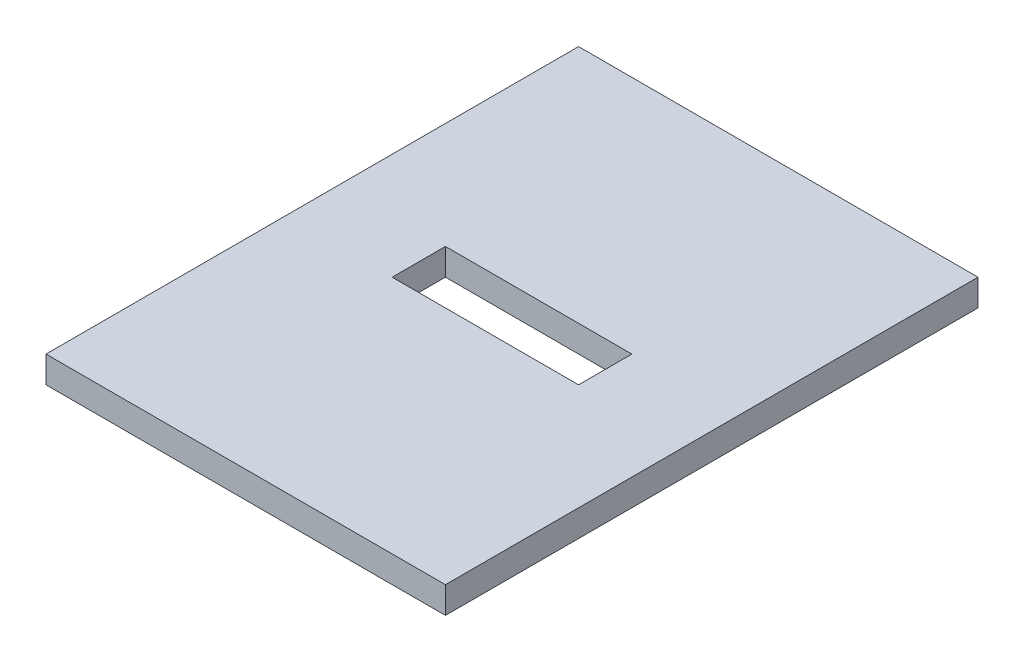
ISO-10303-21;
HEADER;
FILE_DESCRIPTION(('STEP AP214'),'2;1');
FILE_NAME('part.step','',(''),(''),'','','');
FILE_SCHEMA(('AUTOMOTIVE_DESIGN { 1 0 10303 214 1 1 1 1 }'));
ENDSEC;
DATA;
#1=APPLICATION_CONTEXT('core data for automotive mechanical design processes');
#2=APPLICATION_PROTOCOL_DEFINITION('international standard','automotive_design',2000,#1);
#3=PRODUCT_CONTEXT('',#1,'mechanical');
#4=PRODUCT('Part','Part','',(#3));
#5=PRODUCT_RELATED_PRODUCT_CATEGORY('part','',(#4));
#6=PRODUCT_DEFINITION_FORMATION('','',#4);
#7=PRODUCT_DEFINITION_CONTEXT('part definition',#1,'design');
#8=PRODUCT_DEFINITION('design','',#6,#7);
#9=PRODUCT_DEFINITION_SHAPE('','',#8);
#10=(LENGTH_UNIT() NAMED_UNIT(*) SI_UNIT(.MILLI.,.METRE.));
#11=(NAMED_UNIT(*) PLANE_ANGLE_UNIT() SI_UNIT($,.RADIAN.));
#12=(NAMED_UNIT(*) SI_UNIT($,.STERADIAN.) SOLID_ANGLE_UNIT());
#13=UNCERTAINTY_MEASURE_WITH_UNIT(LENGTH_MEASURE(1.E-05),#10,'distance_accuracy_value','');
#14=(GEOMETRIC_REPRESENTATION_CONTEXT(3) GLOBAL_UNCERTAINTY_ASSIGNED_CONTEXT((#13)) GLOBAL_UNIT_ASSIGNED_CONTEXT((#10,
#11,#12)) REPRESENTATION_CONTEXT('',''));
#15=CARTESIAN_POINT('',(0.,0.,0.));
#16=DIRECTION('',(0.,0.,1.));
#17=DIRECTION('',(1.,0.,0.));
#18=AXIS2_PLACEMENT_3D('',#15,#16,#17);
#19=CARTESIAN_POINT('',(-50.,10.,50.));
#20=DIRECTION('',(1.,0.,0.));
#21=DIRECTION('',(0.,0.,-1.));
#22=AXIS2_PLACEMENT_3D('',#19,#20,#21);
#23=PLANE('',#22);
#24=DIRECTION('',(0.,0.,1.));
#25=VECTOR('',#24,1.);
#26=CARTESIAN_POINT('',(-50.,0.,50.));
#27=LINE('',#26,#25);
#28=CARTESIAN_POINT('',(-50.,0.,-150.));
#29=VERTEX_POINT('',#28);
#30=CARTESIAN_POINT('',(-50.,0.,50.));
#31=VERTEX_POINT('',#30);
#32=EDGE_CURVE('E122',#29,#31,#27,.T.);
#33=ORIENTED_EDGE('',*,*,#32,.T.);
#34=DIRECTION('',(0.,-1.,0.));
#35=VECTOR('',#34,1.);
#36=CARTESIAN_POINT('',(-50.,10.,50.));
#37=LINE('',#36,#35);
#38=CARTESIAN_POINT('',(-50.,10.,50.));
#39=VERTEX_POINT('',#38);
#40=EDGE_CURVE('E153',#39,#31,#37,.T.);
#41=ORIENTED_EDGE('',*,*,#40,.F.);
#42=DIRECTION('',(0.,0.,1.));
#43=VECTOR('',#42,1.);
#44=CARTESIAN_POINT('',(-50.,10.,50.));
#45=LINE('',#44,#43);
#46=CARTESIAN_POINT('',(-50.,10.,-150.));
#47=VERTEX_POINT('',#46);
#48=EDGE_CURVE('E127',#47,#39,#45,.T.);
#49=ORIENTED_EDGE('',*,*,#48,.F.);
#50=DIRECTION('',(0.,-1.,0.));
#51=VECTOR('',#50,1.);
#52=CARTESIAN_POINT('',(-50.,10.,-150.));
#53=LINE('',#52,#51);
#54=EDGE_CURVE('E137',#47,#29,#53,.T.);
#55=ORIENTED_EDGE('',*,*,#54,.T.);
#56=EDGE_LOOP('',(#33,#41,#49,#55));
#57=FACE_BOUND('',#56,.T.);
#58=ADVANCED_FACE('F35',(#57),#23,.F.);
#59=CARTESIAN_POINT('',(-50.,10.,50.));
#60=DIRECTION('',(0.,0.,-1.));
#61=DIRECTION('',(-1.,0.,0.));
#62=AXIS2_PLACEMENT_3D('',#59,#60,#61);
#63=PLANE('',#62);
#64=DIRECTION('',(1.,0.,0.));
#65=VECTOR('',#64,1.);
#66=CARTESIAN_POINT('',(-50.,0.,50.));
#67=LINE('',#66,#65);
#68=CARTESIAN_POINT('',(100.,0.,50.));
#69=VERTEX_POINT('',#68);
#70=EDGE_CURVE('E140',#31,#69,#67,.T.);
#71=ORIENTED_EDGE('',*,*,#70,.T.);
#72=DIRECTION('',(0.,-1.,0.));
#73=VECTOR('',#72,1.);
#74=CARTESIAN_POINT('',(100.,10.,50.));
#75=LINE('',#74,#73);
#76=CARTESIAN_POINT('',(100.,10.,50.));
#77=VERTEX_POINT('',#76);
#78=EDGE_CURVE('E150',#77,#69,#75,.T.);
#79=ORIENTED_EDGE('',*,*,#78,.F.);
#80=DIRECTION('',(1.,0.,0.));
#81=VECTOR('',#80,1.);
#82=CARTESIAN_POINT('',(-50.,10.,50.));
#83=LINE('',#82,#81);
#84=EDGE_CURVE('E130',#39,#77,#83,.T.);
#85=ORIENTED_EDGE('',*,*,#84,.F.);
#86=ORIENTED_EDGE('',*,*,#40,.T.);
#87=EDGE_LOOP('',(#71,#79,#85,#86));
#88=FACE_BOUND('',#87,.T.);
#89=ADVANCED_FACE('F176',(#88),#63,.F.);
#90=CARTESIAN_POINT('',(100.,10.,50.));
#91=DIRECTION('',(-1.,0.,0.));
#92=DIRECTION('',(0.,0.,1.));
#93=AXIS2_PLACEMENT_3D('',#90,#91,#92);
#94=PLANE('',#93);
#95=DIRECTION('',(0.,0.,-1.));
#96=VECTOR('',#95,1.);
#97=CARTESIAN_POINT('',(100.,0.,50.));
#98=LINE('',#97,#96);
#99=CARTESIAN_POINT('',(100.,0.,-150.));
#100=VERTEX_POINT('',#99);
#101=EDGE_CURVE('E142',#69,#100,#98,.T.);
#102=ORIENTED_EDGE('',*,*,#101,.T.);
#103=DIRECTION('',(0.,-1.,0.));
#104=VECTOR('',#103,1.);
#105=CARTESIAN_POINT('',(100.,10.,-150.));
#106=LINE('',#105,#104);
#107=CARTESIAN_POINT('',(100.,10.,-150.));
#108=VERTEX_POINT('',#107);
#109=EDGE_CURVE('E147',#108,#100,#106,.T.);
#110=ORIENTED_EDGE('',*,*,#109,.F.);
#111=DIRECTION('',(0.,0.,-1.));
#112=VECTOR('',#111,1.);
#113=CARTESIAN_POINT('',(100.,10.,50.));
#114=LINE('',#113,#112);
#115=EDGE_CURVE('E133',#77,#108,#114,.T.);
#116=ORIENTED_EDGE('',*,*,#115,.F.);
#117=ORIENTED_EDGE('',*,*,#78,.T.);
#118=EDGE_LOOP('',(#102,#110,#116,#117));
#119=FACE_BOUND('',#118,.T.);
#120=ADVANCED_FACE('F181',(#119),#94,.F.);
#121=CARTESIAN_POINT('',(-50.,10.,-150.));
#122=DIRECTION('',(0.,0.,1.));
#123=DIRECTION('',(1.,0.,0.));
#124=AXIS2_PLACEMENT_3D('',#121,#122,#123);
#125=PLANE('',#124);
#126=DIRECTION('',(-1.,0.,0.));
#127=VECTOR('',#126,1.);
#128=CARTESIAN_POINT('',(-50.,0.,-150.));
#129=LINE('',#128,#127);
#130=EDGE_CURVE('E131',#100,#29,#129,.T.);
#131=ORIENTED_EDGE('',*,*,#130,.T.);
#132=ORIENTED_EDGE('',*,*,#54,.F.);
#133=DIRECTION('',(-1.,0.,0.));
#134=VECTOR('',#133,1.);
#135=CARTESIAN_POINT('',(-50.,10.,-150.));
#136=LINE('',#135,#134);
#137=EDGE_CURVE('E135',#108,#47,#136,.T.);
#138=ORIENTED_EDGE('',*,*,#137,.F.);
#139=ORIENTED_EDGE('',*,*,#109,.T.);
#140=EDGE_LOOP('',(#131,#132,#138,#139));
#141=FACE_BOUND('',#140,.T.);
#142=ADVANCED_FACE('F194',(#141),#125,.F.);
#143=CARTESIAN_POINT('',(0.,10.,0.));
#144=DIRECTION('',(0.,-1.,0.));
#145=DIRECTION('',(0.,0.,-1.));
#146=AXIS2_PLACEMENT_3D('',#143,#144,#145);
#147=PLANE('',#146);
#148=DIRECTION('',(-1.,0.,0.));
#149=VECTOR('',#148,1.);
#150=CARTESIAN_POINT('',(-10.,10.,-40.));
#151=LINE('',#150,#149);
#152=CARTESIAN_POINT('',(60.,10.,-40.));
#153=VERTEX_POINT('',#152);
#154=CARTESIAN_POINT('',(-10.,10.,-40.));
#155=VERTEX_POINT('',#154);
#156=EDGE_CURVE('E106',#153,#155,#151,.T.);
#157=ORIENTED_EDGE('',*,*,#156,.T.);
#158=DIRECTION('',(0.,0.,-1.));
#159=VECTOR('',#158,1.);
#160=CARTESIAN_POINT('',(-10.,10.,-40.));
#161=LINE('',#160,#159);
#162=CARTESIAN_POINT('',(-10.,10.,-60.));
#163=VERTEX_POINT('',#162);
#164=EDGE_CURVE('E101',#155,#163,#161,.T.);
#165=ORIENTED_EDGE('',*,*,#164,.T.);
#166=DIRECTION('',(1.,0.,0.));
#167=VECTOR('',#166,1.);
#168=CARTESIAN_POINT('',(-10.,10.,-60.));
#169=LINE('',#168,#167);
#170=CARTESIAN_POINT('',(60.,10.,-60.));
#171=VERTEX_POINT('',#170);
#172=EDGE_CURVE('E109',#163,#171,#169,.T.);
#173=ORIENTED_EDGE('',*,*,#172,.T.);
#174=DIRECTION('',(0.,0.,1.));
#175=VECTOR('',#174,1.);
#176=CARTESIAN_POINT('',(60.,10.,-40.));
#177=LINE('',#176,#175);
#178=EDGE_CURVE('E49',#171,#153,#177,.T.);
#179=ORIENTED_EDGE('',*,*,#178,.T.);
#180=EDGE_LOOP('',(#157,#165,#173,#179));
#181=FACE_BOUND('',#180,.T.);
#182=ORIENTED_EDGE('',*,*,#48,.T.);
#183=ORIENTED_EDGE('',*,*,#84,.T.);
#184=ORIENTED_EDGE('',*,*,#115,.T.);
#185=ORIENTED_EDGE('',*,*,#137,.T.);
#186=EDGE_LOOP('',(#182,#183,#184,#185));
#187=FACE_BOUND('',#186,.T.);
#188=ADVANCED_FACE('F113',(#181,#187),#147,.F.);
#189=CARTESIAN_POINT('',(0.,0.,0.));
#190=DIRECTION('',(0.,-1.,0.));
#191=DIRECTION('',(0.,0.,-1.));
#192=AXIS2_PLACEMENT_3D('',#189,#190,#191);
#193=PLANE('',#192);
#194=DIRECTION('',(0.,0.,-1.));
#195=VECTOR('',#194,1.);
#196=CARTESIAN_POINT('',(-10.,0.,0.));
#197=LINE('',#196,#195);
#198=CARTESIAN_POINT('',(-10.,0.,-40.));
#199=VERTEX_POINT('',#198);
#200=CARTESIAN_POINT('',(-10.,0.,-60.));
#201=VERTEX_POINT('',#200);
#202=EDGE_CURVE('E11',#199,#201,#197,.T.);
#203=ORIENTED_EDGE('',*,*,#202,.F.);
#204=DIRECTION('',(-1.,0.,0.));
#205=VECTOR('',#204,1.);
#206=CARTESIAN_POINT('',(0.,0.,-40.));
#207=LINE('',#206,#205);
#208=CARTESIAN_POINT('',(60.,0.,-40.));
#209=VERTEX_POINT('',#208);
#210=EDGE_CURVE('E42',#209,#199,#207,.T.);
#211=ORIENTED_EDGE('',*,*,#210,.F.);
#212=DIRECTION('',(0.,0.,1.));
#213=VECTOR('',#212,1.);
#214=CARTESIAN_POINT('',(60.,0.,0.));
#215=LINE('',#214,#213);
#216=CARTESIAN_POINT('',(60.,0.,-60.));
#217=VERTEX_POINT('',#216);
#218=EDGE_CURVE('E158',#217,#209,#215,.T.);
#219=ORIENTED_EDGE('',*,*,#218,.F.);
#220=DIRECTION('',(1.,0.,0.));
#221=VECTOR('',#220,1.);
#222=CARTESIAN_POINT('',(0.,0.,-60.));
#223=LINE('',#222,#221);
#224=EDGE_CURVE('E156',#201,#217,#223,.T.);
#225=ORIENTED_EDGE('',*,*,#224,.F.);
#226=EDGE_LOOP('',(#203,#211,#219,#225));
#227=FACE_BOUND('',#226,.T.);
#228=ORIENTED_EDGE('',*,*,#32,.F.);
#229=ORIENTED_EDGE('',*,*,#130,.F.);
#230=ORIENTED_EDGE('',*,*,#101,.F.);
#231=ORIENTED_EDGE('',*,*,#70,.F.);
#232=EDGE_LOOP('',(#228,#229,#230,#231));
#233=FACE_BOUND('',#232,.T.);
#234=ADVANCED_FACE('F164',(#227,#233),#193,.T.);
#235=CARTESIAN_POINT('',(-10.,10.,-40.));
#236=DIRECTION('',(-1.,0.,0.));
#237=DIRECTION('',(0.,0.,1.));
#238=AXIS2_PLACEMENT_3D('',#235,#236,#237);
#239=PLANE('',#238);
#240=ORIENTED_EDGE('',*,*,#202,.T.);
#241=DIRECTION('',(0.,-1.,0.));
#242=VECTOR('',#241,1.);
#243=CARTESIAN_POINT('',(-10.,10.,-60.));
#244=LINE('',#243,#242);
#245=EDGE_CURVE('E57',#163,#201,#244,.T.);
#246=ORIENTED_EDGE('',*,*,#245,.F.);
#247=ORIENTED_EDGE('',*,*,#164,.F.);
#248=DIRECTION('',(0.,-1.,0.));
#249=VECTOR('',#248,1.);
#250=CARTESIAN_POINT('',(-10.,10.,-40.));
#251=LINE('',#250,#249);
#252=EDGE_CURVE('E120',#155,#199,#251,.T.);
#253=ORIENTED_EDGE('',*,*,#252,.T.);
#254=EDGE_LOOP('',(#240,#246,#247,#253));
#255=FACE_BOUND('',#254,.T.);
#256=ADVANCED_FACE('F98',(#255),#239,.F.);
#257=CARTESIAN_POINT('',(-10.,10.,-40.));
#258=DIRECTION('',(0.,0.,1.));
#259=DIRECTION('',(1.,0.,0.));
#260=AXIS2_PLACEMENT_3D('',#257,#258,#259);
#261=PLANE('',#260);
#262=ORIENTED_EDGE('',*,*,#210,.T.);
#263=ORIENTED_EDGE('',*,*,#252,.F.);
#264=ORIENTED_EDGE('',*,*,#156,.F.);
#265=DIRECTION('',(0.,-1.,0.));
#266=VECTOR('',#265,1.);
#267=CARTESIAN_POINT('',(60.,10.,-40.));
#268=LINE('',#267,#266);
#269=EDGE_CURVE('E123',#153,#209,#268,.T.);
#270=ORIENTED_EDGE('',*,*,#269,.T.);
#271=EDGE_LOOP('',(#262,#263,#264,#270));
#272=FACE_BOUND('',#271,.T.);
#273=ADVANCED_FACE('F161',(#272),#261,.F.);
#274=CARTESIAN_POINT('',(60.,10.,-40.));
#275=DIRECTION('',(1.,0.,0.));
#276=DIRECTION('',(0.,0.,-1.));
#277=AXIS2_PLACEMENT_3D('',#274,#275,#276);
#278=PLANE('',#277);
#279=ORIENTED_EDGE('',*,*,#218,.T.);
#280=ORIENTED_EDGE('',*,*,#269,.F.);
#281=ORIENTED_EDGE('',*,*,#178,.F.);
#282=DIRECTION('',(0.,-1.,0.));
#283=VECTOR('',#282,1.);
#284=CARTESIAN_POINT('',(60.,10.,-60.));
#285=LINE('',#284,#283);
#286=EDGE_CURVE('E105',#171,#217,#285,.T.);
#287=ORIENTED_EDGE('',*,*,#286,.T.);
#288=EDGE_LOOP('',(#279,#280,#281,#287));
#289=FACE_BOUND('',#288,.T.);
#290=ADVANCED_FACE('F166',(#289),#278,.F.);
#291=CARTESIAN_POINT('',(-10.,10.,-60.));
#292=DIRECTION('',(0.,0.,-1.));
#293=DIRECTION('',(-1.,0.,0.));
#294=AXIS2_PLACEMENT_3D('',#291,#292,#293);
#295=PLANE('',#294);
#296=ORIENTED_EDGE('',*,*,#224,.T.);
#297=ORIENTED_EDGE('',*,*,#286,.F.);
#298=ORIENTED_EDGE('',*,*,#172,.F.);
#299=ORIENTED_EDGE('',*,*,#245,.T.);
#300=EDGE_LOOP('',(#296,#297,#298,#299));
#301=FACE_BOUND('',#300,.T.);
#302=ADVANCED_FACE('F110',(#301),#295,.F.);
#303=CLOSED_SHELL('',(#58,#89,#120,#142,#188,#234,#256,#273,#290,#302));
#304=MANIFOLD_SOLID_BREP('B2',#303);
#305=ADVANCED_BREP_SHAPE_REPRESENTATION('',(#18,#304),#14);
#306=SHAPE_DEFINITION_REPRESENTATION(#9,#305);
ENDSEC;
END-ISO-10303-21;
